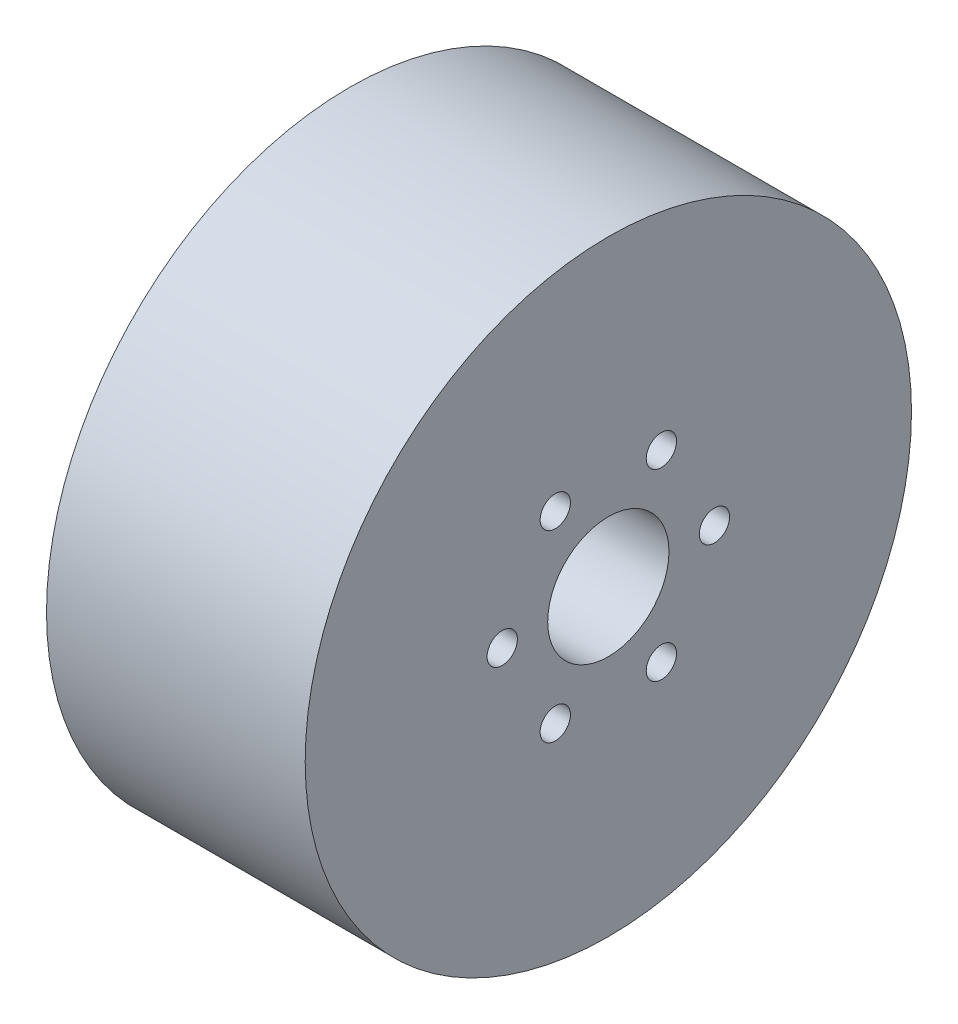
ISO-10303-21;
HEADER;
FILE_DESCRIPTION(('STEP AP214'),'2;1');
FILE_NAME('part.step','',(''),(''),'','','');
FILE_SCHEMA(('AUTOMOTIVE_DESIGN { 1 0 10303 214 1 1 1 1 }'));
ENDSEC;
DATA;
#1=APPLICATION_CONTEXT('core data for automotive mechanical design processes');
#2=APPLICATION_PROTOCOL_DEFINITION('international standard','automotive_design',2000,#1);
#3=PRODUCT_CONTEXT('',#1,'mechanical');
#4=PRODUCT('Part','Part','',(#3));
#5=PRODUCT_RELATED_PRODUCT_CATEGORY('part','',(#4));
#6=PRODUCT_DEFINITION_FORMATION('','',#4);
#7=PRODUCT_DEFINITION_CONTEXT('part definition',#1,'design');
#8=PRODUCT_DEFINITION('design','',#6,#7);
#9=PRODUCT_DEFINITION_SHAPE('','',#8);
#10=(LENGTH_UNIT() NAMED_UNIT(*) SI_UNIT(.MILLI.,.METRE.));
#11=(NAMED_UNIT(*) PLANE_ANGLE_UNIT() SI_UNIT($,.RADIAN.));
#12=(NAMED_UNIT(*) SI_UNIT($,.STERADIAN.) SOLID_ANGLE_UNIT());
#13=UNCERTAINTY_MEASURE_WITH_UNIT(LENGTH_MEASURE(1.E-05),#10,'distance_accuracy_value','');
#14=(GEOMETRIC_REPRESENTATION_CONTEXT(3) GLOBAL_UNCERTAINTY_ASSIGNED_CONTEXT((#13)) GLOBAL_UNIT_ASSIGNED_CONTEXT((#10,
#11,#12)) REPRESENTATION_CONTEXT('',''));
#15=CARTESIAN_POINT('',(0.,0.,0.));
#16=DIRECTION('',(0.,0.,1.));
#17=DIRECTION('',(1.,0.,0.));
#18=AXIS2_PLACEMENT_3D('',#15,#16,#17);
#19=CARTESIAN_POINT('',(25.6,0.,0.));
#20=DIRECTION('',(-1.,0.,0.));
#21=DIRECTION('',(0.,0.,1.));
#22=AXIS2_PLACEMENT_3D('',#19,#20,#21);
#23=CYLINDRICAL_SURFACE('',#22,30.);
#24=CARTESIAN_POINT('',(25.6,0.,0.));
#25=DIRECTION('',(1.,0.,0.));
#26=DIRECTION('',(0.,0.,-1.));
#27=AXIS2_PLACEMENT_3D('',#24,#25,#26);
#28=CIRCLE('',#27,30.);
#29=CARTESIAN_POINT('',(25.6,0.,-30.));
#30=VERTEX_POINT('',#29);
#31=EDGE_CURVE('E10',#30,#30,#28,.T.);
#32=ORIENTED_EDGE('',*,*,#31,.F.);
#33=EDGE_LOOP('',(#32));
#34=FACE_BOUND('',#33,.T.);
#35=CARTESIAN_POINT('',(0.,0.,0.));
#36=DIRECTION('',(1.,0.,0.));
#37=DIRECTION('',(0.,0.,-1.));
#38=AXIS2_PLACEMENT_3D('',#35,#36,#37);
#39=CIRCLE('',#38,30.);
#40=CARTESIAN_POINT('',(0.,0.,-30.));
#41=VERTEX_POINT('',#40);
#42=EDGE_CURVE('E33',#41,#41,#39,.T.);
#43=ORIENTED_EDGE('',*,*,#42,.T.);
#44=EDGE_LOOP('',(#43));
#45=FACE_BOUND('',#44,.T.);
#46=ADVANCED_FACE('F30',(#34,#45),#23,.T.);
#47=CARTESIAN_POINT('',(25.6,0.,0.));
#48=DIRECTION('',(1.,0.,0.));
#49=DIRECTION('',(0.,0.,-1.));
#50=AXIS2_PLACEMENT_3D('',#47,#48,#49);
#51=PLANE('',#50);
#52=CARTESIAN_POINT('',(25.6,9.09326673973655,5.25000000000011));
#53=DIRECTION('',(1.,0.,0.));
#54=DIRECTION('',(0.,0.,-1.));
#55=AXIS2_PLACEMENT_3D('',#52,#53,#54);
#56=CIRCLE('',#55,1.5);
#57=CARTESIAN_POINT('',(25.6,9.09326673973655,3.75000000000011));
#58=VERTEX_POINT('',#57);
#59=EDGE_CURVE('E47',#58,#58,#56,.T.);
#60=ORIENTED_EDGE('',*,*,#59,.F.);
#61=EDGE_LOOP('',(#60));
#62=FACE_BOUND('',#61,.T.);
#63=CARTESIAN_POINT('',(25.6,9.09326673973665,-5.24999999999992));
#64=DIRECTION('',(1.,0.,0.));
#65=DIRECTION('',(0.,0.,-1.));
#66=AXIS2_PLACEMENT_3D('',#63,#64,#65);
#67=CIRCLE('',#66,1.5);
#68=CARTESIAN_POINT('',(25.6,9.09326673973665,-6.74999999999991));
#69=VERTEX_POINT('',#68);
#70=EDGE_CURVE('E50',#69,#69,#67,.T.);
#71=ORIENTED_EDGE('',*,*,#70,.F.);
#72=EDGE_LOOP('',(#71));
#73=FACE_BOUND('',#72,.T.);
#74=CARTESIAN_POINT('',(25.6,0.,-10.5));
#75=DIRECTION('',(1.,0.,0.));
#76=DIRECTION('',(0.,0.,-1.));
#77=AXIS2_PLACEMENT_3D('',#74,#75,#76);
#78=CIRCLE('',#77,1.5);
#79=CARTESIAN_POINT('',(25.6,0.,-12.));
#80=VERTEX_POINT('',#79);
#81=EDGE_CURVE('E53',#80,#80,#78,.T.);
#82=ORIENTED_EDGE('',*,*,#81,.F.);
#83=EDGE_LOOP('',(#82));
#84=FACE_BOUND('',#83,.T.);
#85=CARTESIAN_POINT('',(25.6,-9.09326673973658,-5.25000000000004));
#86=DIRECTION('',(1.,0.,0.));
#87=DIRECTION('',(0.,0.,-1.));
#88=AXIS2_PLACEMENT_3D('',#85,#86,#87);
#89=CIRCLE('',#88,1.5);
#90=CARTESIAN_POINT('',(25.6,-9.09326673973658,-6.75000000000004));
#91=VERTEX_POINT('',#90);
#92=EDGE_CURVE('E56',#91,#91,#89,.T.);
#93=ORIENTED_EDGE('',*,*,#92,.F.);
#94=EDGE_LOOP('',(#93));
#95=FACE_BOUND('',#94,.T.);
#96=CARTESIAN_POINT('',(25.6,-9.09326673973662,5.24999999999998));
#97=DIRECTION('',(1.,0.,0.));
#98=DIRECTION('',(0.,0.,-1.));
#99=AXIS2_PLACEMENT_3D('',#96,#97,#98);
#100=CIRCLE('',#99,1.5);
#101=CARTESIAN_POINT('',(25.6,-9.09326673973662,3.74999999999998));
#102=VERTEX_POINT('',#101);
#103=EDGE_CURVE('E59',#102,#102,#100,.T.);
#104=ORIENTED_EDGE('',*,*,#103,.F.);
#105=EDGE_LOOP('',(#104));
#106=FACE_BOUND('',#105,.T.);
#107=CARTESIAN_POINT('',(25.6,0.,10.5));
#108=DIRECTION('',(1.,0.,0.));
#109=DIRECTION('',(0.,0.,-1.));
#110=AXIS2_PLACEMENT_3D('',#107,#108,#109);
#111=CIRCLE('',#110,1.5);
#112=CARTESIAN_POINT('',(25.6,0.,9.));
#113=VERTEX_POINT('',#112);
#114=EDGE_CURVE('E62',#113,#113,#111,.T.);
#115=ORIENTED_EDGE('',*,*,#114,.F.);
#116=EDGE_LOOP('',(#115));
#117=FACE_BOUND('',#116,.T.);
#118=CARTESIAN_POINT('',(25.6,0.,0.));
#119=DIRECTION('',(1.,0.,0.));
#120=DIRECTION('',(0.,0.,-1.));
#121=AXIS2_PLACEMENT_3D('',#118,#119,#120);
#122=CIRCLE('',#121,6.);
#123=CARTESIAN_POINT('',(25.6,0.,-6.));
#124=VERTEX_POINT('',#123);
#125=EDGE_CURVE('E40',#124,#124,#122,.T.);
#126=ORIENTED_EDGE('',*,*,#125,.F.);
#127=EDGE_LOOP('',(#126));
#128=FACE_BOUND('',#127,.T.);
#129=ORIENTED_EDGE('',*,*,#31,.T.);
#130=EDGE_LOOP('',(#129));
#131=FACE_BOUND('',#130,.T.);
#132=ADVANCED_FACE('F90',(#62,#73,#84,#95,#106,#117,#128,#131),#51,.T.);
#133=CARTESIAN_POINT('',(0.,0.,0.));
#134=DIRECTION('',(1.,0.,0.));
#135=DIRECTION('',(0.,0.,-1.));
#136=AXIS2_PLACEMENT_3D('',#133,#134,#135);
#137=PLANE('',#136);
#138=CARTESIAN_POINT('',(0.,9.09326673973655,5.25000000000011));
#139=DIRECTION('',(-1.,0.,0.));
#140=DIRECTION('',(0.,0.,1.));
#141=AXIS2_PLACEMENT_3D('',#138,#139,#140);
#142=CIRCLE('',#141,1.5);
#143=CARTESIAN_POINT('',(0.,9.09326673973655,6.7500000000001));
#144=VERTEX_POINT('',#143);
#145=EDGE_CURVE('E75',#144,#144,#142,.T.);
#146=ORIENTED_EDGE('',*,*,#145,.F.);
#147=EDGE_LOOP('',(#146));
#148=FACE_BOUND('',#147,.T.);
#149=CARTESIAN_POINT('',(0.,9.09326673973665,-5.24999999999992));
#150=DIRECTION('',(-1.,0.,0.));
#151=DIRECTION('',(0.,0.,1.));
#152=AXIS2_PLACEMENT_3D('',#149,#150,#151);
#153=CIRCLE('',#152,1.5);
#154=CARTESIAN_POINT('',(0.,9.09326673973665,-3.74999999999992));
#155=VERTEX_POINT('',#154);
#156=EDGE_CURVE('E78',#155,#155,#153,.T.);
#157=ORIENTED_EDGE('',*,*,#156,.F.);
#158=EDGE_LOOP('',(#157));
#159=FACE_BOUND('',#158,.T.);
#160=CARTESIAN_POINT('',(0.,0.,-10.5));
#161=DIRECTION('',(-1.,0.,0.));
#162=DIRECTION('',(0.,0.,1.));
#163=AXIS2_PLACEMENT_3D('',#160,#161,#162);
#164=CIRCLE('',#163,1.5);
#165=CARTESIAN_POINT('',(0.,0.,-9.));
#166=VERTEX_POINT('',#165);
#167=EDGE_CURVE('E70',#166,#166,#164,.T.);
#168=ORIENTED_EDGE('',*,*,#167,.F.);
#169=EDGE_LOOP('',(#168));
#170=FACE_BOUND('',#169,.T.);
#171=CARTESIAN_POINT('',(0.,-9.09326673973658,-5.25000000000004));
#172=DIRECTION('',(-1.,0.,0.));
#173=DIRECTION('',(0.,0.,1.));
#174=AXIS2_PLACEMENT_3D('',#171,#172,#173);
#175=CIRCLE('',#174,1.5);
#176=CARTESIAN_POINT('',(0.,-9.09326673973658,-3.75000000000005));
#177=VERTEX_POINT('',#176);
#178=EDGE_CURVE('E66',#177,#177,#175,.T.);
#179=ORIENTED_EDGE('',*,*,#178,.F.);
#180=EDGE_LOOP('',(#179));
#181=FACE_BOUND('',#180,.T.);
#182=CARTESIAN_POINT('',(0.,-9.09326673973662,5.24999999999998));
#183=DIRECTION('',(-1.,0.,0.));
#184=DIRECTION('',(0.,0.,1.));
#185=AXIS2_PLACEMENT_3D('',#182,#183,#184);
#186=CIRCLE('',#185,1.5);
#187=CARTESIAN_POINT('',(0.,-9.09326673973662,6.74999999999998));
#188=VERTEX_POINT('',#187);
#189=EDGE_CURVE('E69',#188,#188,#186,.T.);
#190=ORIENTED_EDGE('',*,*,#189,.F.);
#191=EDGE_LOOP('',(#190));
#192=FACE_BOUND('',#191,.T.);
#193=CARTESIAN_POINT('',(0.,0.,10.5));
#194=DIRECTION('',(-1.,0.,0.));
#195=DIRECTION('',(0.,0.,1.));
#196=AXIS2_PLACEMENT_3D('',#193,#194,#195);
#197=CIRCLE('',#196,1.5);
#198=CARTESIAN_POINT('',(0.,0.,12.));
#199=VERTEX_POINT('',#198);
#200=EDGE_CURVE('E65',#199,#199,#197,.T.);
#201=ORIENTED_EDGE('',*,*,#200,.F.);
#202=EDGE_LOOP('',(#201));
#203=FACE_BOUND('',#202,.T.);
#204=CARTESIAN_POINT('',(0.,0.,0.));
#205=DIRECTION('',(-1.,0.,0.));
#206=DIRECTION('',(0.,0.,1.));
#207=AXIS2_PLACEMENT_3D('',#204,#205,#206);
#208=CIRCLE('',#207,6.);
#209=CARTESIAN_POINT('',(0.,0.,6.));
#210=VERTEX_POINT('',#209);
#211=EDGE_CURVE('E44',#210,#210,#208,.T.);
#212=ORIENTED_EDGE('',*,*,#211,.F.);
#213=EDGE_LOOP('',(#212));
#214=FACE_BOUND('',#213,.T.);
#215=ORIENTED_EDGE('',*,*,#42,.F.);
#216=EDGE_LOOP('',(#215));
#217=FACE_BOUND('',#216,.T.);
#218=ADVANCED_FACE('F86',(#148,#159,#170,#181,#192,#203,#214,#217),#137,.F.);
#219=CARTESIAN_POINT('',(30.,0.,0.));
#220=DIRECTION('',(-1.,0.,0.));
#221=DIRECTION('',(0.,0.,1.));
#222=AXIS2_PLACEMENT_3D('',#219,#220,#221);
#223=CYLINDRICAL_SURFACE('',#222,6.);
#224=ORIENTED_EDGE('',*,*,#125,.T.);
#225=EDGE_LOOP('',(#224));
#226=FACE_BOUND('',#225,.T.);
#227=ORIENTED_EDGE('',*,*,#211,.T.);
#228=EDGE_LOOP('',(#227));
#229=FACE_BOUND('',#228,.T.);
#230=ADVANCED_FACE('F89',(#226,#229),#223,.F.);
#231=CARTESIAN_POINT('',(30.,0.,10.5));
#232=DIRECTION('',(-1.,0.,0.));
#233=DIRECTION('',(0.,0.,1.));
#234=AXIS2_PLACEMENT_3D('',#231,#232,#233);
#235=CYLINDRICAL_SURFACE('',#234,1.5);
#236=ORIENTED_EDGE('',*,*,#114,.T.);
#237=EDGE_LOOP('',(#236));
#238=FACE_BOUND('',#237,.T.);
#239=ORIENTED_EDGE('',*,*,#200,.T.);
#240=EDGE_LOOP('',(#239));
#241=FACE_BOUND('',#240,.T.);
#242=ADVANCED_FACE('F116',(#238,#241),#235,.F.);
#243=CARTESIAN_POINT('',(30.,-9.09326673973662,5.24999999999998));
#244=DIRECTION('',(-1.,0.,0.));
#245=DIRECTION('',(0.,0.,1.));
#246=AXIS2_PLACEMENT_3D('',#243,#244,#245);
#247=CYLINDRICAL_SURFACE('',#246,1.5);
#248=ORIENTED_EDGE('',*,*,#103,.T.);
#249=EDGE_LOOP('',(#248));
#250=FACE_BOUND('',#249,.T.);
#251=ORIENTED_EDGE('',*,*,#189,.T.);
#252=EDGE_LOOP('',(#251));
#253=FACE_BOUND('',#252,.T.);
#254=ADVANCED_FACE('F121',(#250,#253),#247,.F.);
#255=CARTESIAN_POINT('',(30.,-9.09326673973658,-5.25000000000004));
#256=DIRECTION('',(-1.,0.,0.));
#257=DIRECTION('',(0.,0.,1.));
#258=AXIS2_PLACEMENT_3D('',#255,#256,#257);
#259=CYLINDRICAL_SURFACE('',#258,1.5);
#260=ORIENTED_EDGE('',*,*,#92,.T.);
#261=EDGE_LOOP('',(#260));
#262=FACE_BOUND('',#261,.T.);
#263=ORIENTED_EDGE('',*,*,#178,.T.);
#264=EDGE_LOOP('',(#263));
#265=FACE_BOUND('',#264,.T.);
#266=ADVANCED_FACE('F118',(#262,#265),#259,.F.);
#267=CARTESIAN_POINT('',(30.,0.,-10.5));
#268=DIRECTION('',(-1.,0.,0.));
#269=DIRECTION('',(0.,0.,1.));
#270=AXIS2_PLACEMENT_3D('',#267,#268,#269);
#271=CYLINDRICAL_SURFACE('',#270,1.5);
#272=ORIENTED_EDGE('',*,*,#81,.T.);
#273=EDGE_LOOP('',(#272));
#274=FACE_BOUND('',#273,.T.);
#275=ORIENTED_EDGE('',*,*,#167,.T.);
#276=EDGE_LOOP('',(#275));
#277=FACE_BOUND('',#276,.T.);
#278=ADVANCED_FACE('F84',(#274,#277),#271,.F.);
#279=CARTESIAN_POINT('',(30.,9.09326673973665,-5.24999999999992));
#280=DIRECTION('',(-1.,0.,0.));
#281=DIRECTION('',(0.,0.,1.));
#282=AXIS2_PLACEMENT_3D('',#279,#280,#281);
#283=CYLINDRICAL_SURFACE('',#282,1.5);
#284=ORIENTED_EDGE('',*,*,#70,.T.);
#285=EDGE_LOOP('',(#284));
#286=FACE_BOUND('',#285,.T.);
#287=ORIENTED_EDGE('',*,*,#156,.T.);
#288=EDGE_LOOP('',(#287));
#289=FACE_BOUND('',#288,.T.);
#290=ADVANCED_FACE('F132',(#286,#289),#283,.F.);
#291=CARTESIAN_POINT('',(30.,9.09326673973655,5.25000000000011));
#292=DIRECTION('',(-1.,0.,0.));
#293=DIRECTION('',(0.,0.,1.));
#294=AXIS2_PLACEMENT_3D('',#291,#292,#293);
#295=CYLINDRICAL_SURFACE('',#294,1.5);
#296=ORIENTED_EDGE('',*,*,#59,.T.);
#297=EDGE_LOOP('',(#296));
#298=FACE_BOUND('',#297,.T.);
#299=ORIENTED_EDGE('',*,*,#145,.T.);
#300=EDGE_LOOP('',(#299));
#301=FACE_BOUND('',#300,.T.);
#302=ADVANCED_FACE('F129',(#298,#301),#295,.F.);
#303=CLOSED_SHELL('',(#46,#132,#218,#230,#242,#254,#266,#278,#290,#302));
#304=MANIFOLD_SOLID_BREP('B2',#303);
#305=ADVANCED_BREP_SHAPE_REPRESENTATION('',(#18,#304),#14);
#306=SHAPE_DEFINITION_REPRESENTATION(#9,#305);
ENDSEC;
END-ISO-10303-21;
